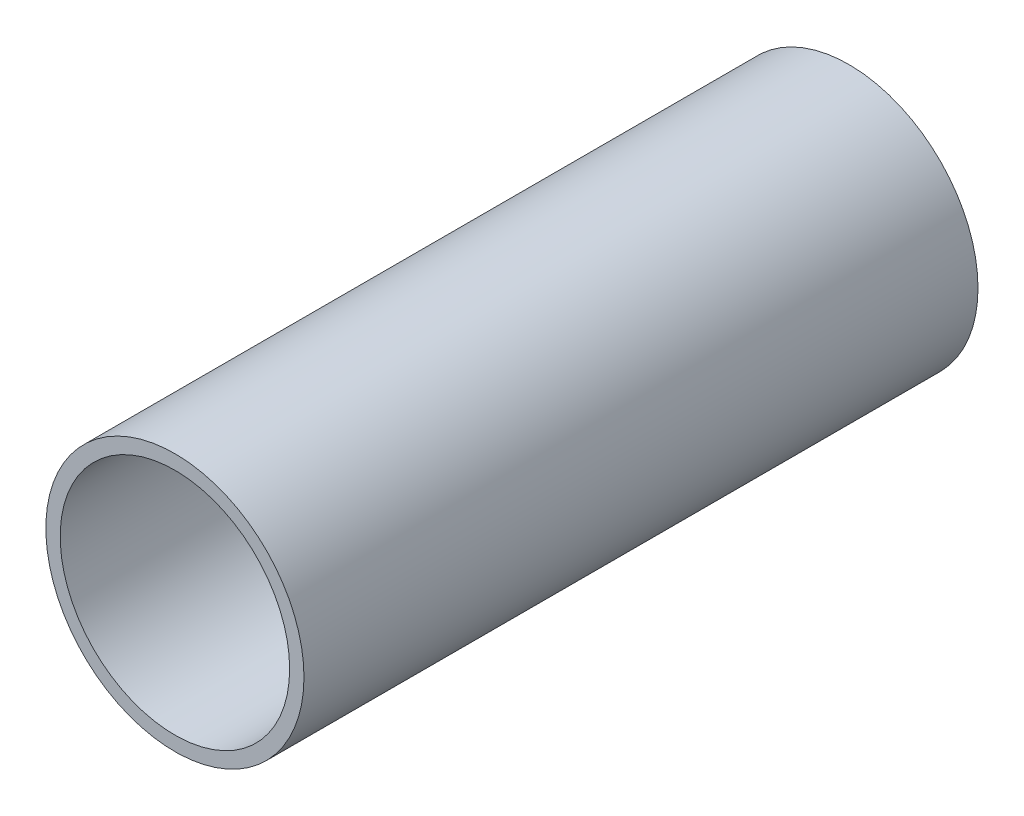
ISO-10303-21;
HEADER;
FILE_DESCRIPTION(('STEP AP214'),'2;1');
FILE_NAME('part.step','',(''),(''),'','','');
FILE_SCHEMA(('AUTOMOTIVE_DESIGN { 1 0 10303 214 1 1 1 1 }'));
ENDSEC;
DATA;
#1=APPLICATION_CONTEXT('core data for automotive mechanical design processes');
#2=APPLICATION_PROTOCOL_DEFINITION('international standard','automotive_design',2000,#1);
#3=PRODUCT_CONTEXT('',#1,'mechanical');
#4=PRODUCT('Part','Part','',(#3));
#5=PRODUCT_RELATED_PRODUCT_CATEGORY('part','',(#4));
#6=PRODUCT_DEFINITION_FORMATION('','',#4);
#7=PRODUCT_DEFINITION_CONTEXT('part definition',#1,'design');
#8=PRODUCT_DEFINITION('design','',#6,#7);
#9=PRODUCT_DEFINITION_SHAPE('','',#8);
#10=(LENGTH_UNIT() NAMED_UNIT(*) SI_UNIT(.MILLI.,.METRE.));
#11=(NAMED_UNIT(*) PLANE_ANGLE_UNIT() SI_UNIT($,.RADIAN.));
#12=(NAMED_UNIT(*) SI_UNIT($,.STERADIAN.) SOLID_ANGLE_UNIT());
#13=UNCERTAINTY_MEASURE_WITH_UNIT(LENGTH_MEASURE(1.E-05),#10,'distance_accuracy_value','');
#14=(GEOMETRIC_REPRESENTATION_CONTEXT(3) GLOBAL_UNCERTAINTY_ASSIGNED_CONTEXT((#13)) GLOBAL_UNIT_ASSIGNED_CONTEXT((#10,
#11,#12)) REPRESENTATION_CONTEXT('',''));
#15=CARTESIAN_POINT('',(0.,0.,0.));
#16=DIRECTION('',(0.,0.,1.));
#17=DIRECTION('',(1.,0.,0.));
#18=AXIS2_PLACEMENT_3D('',#15,#16,#17);
#19=CARTESIAN_POINT('',(0.,0.,149.225));
#20=DIRECTION('',(0.,0.,1.));
#21=DIRECTION('',(1.,0.,0.));
#22=AXIS2_PLACEMENT_3D('',#19,#20,#21);
#23=PLANE('',#22);
#24=CARTESIAN_POINT('',(0.,0.,149.225));
#25=DIRECTION('',(0.,0.,1.));
#26=DIRECTION('',(1.,0.,0.));
#27=AXIS2_PLACEMENT_3D('',#24,#25,#26);
#28=CIRCLE('',#27,57.15);
#29=CARTESIAN_POINT('',(57.15,0.,149.225));
#30=VERTEX_POINT('',#29);
#31=EDGE_CURVE('E10',#30,#30,#28,.T.);
#32=ORIENTED_EDGE('',*,*,#31,.T.);
#33=EDGE_LOOP('',(#32));
#34=FACE_BOUND('',#33,.T.);
#35=CARTESIAN_POINT('',(0.,0.,149.225));
#36=DIRECTION('',(0.,0.,1.));
#37=DIRECTION('',(1.,0.,0.));
#38=AXIS2_PLACEMENT_3D('',#35,#36,#37);
#39=CIRCLE('',#38,50.8);
#40=CARTESIAN_POINT('',(50.8,0.,149.225));
#41=VERTEX_POINT('',#40);
#42=EDGE_CURVE('E43',#41,#41,#39,.T.);
#43=ORIENTED_EDGE('',*,*,#42,.F.);
#44=EDGE_LOOP('',(#43));
#45=FACE_BOUND('',#44,.T.);
#46=ADVANCED_FACE('F32',(#34,#45),#23,.T.);
#47=CARTESIAN_POINT('',(0.,0.,-149.225));
#48=DIRECTION('',(0.,0.,1.));
#49=DIRECTION('',(1.,0.,0.));
#50=AXIS2_PLACEMENT_3D('',#47,#48,#49);
#51=PLANE('',#50);
#52=CARTESIAN_POINT('',(0.,0.,-149.225));
#53=DIRECTION('',(0.,0.,1.));
#54=DIRECTION('',(1.,0.,0.));
#55=AXIS2_PLACEMENT_3D('',#52,#53,#54);
#56=CIRCLE('',#55,57.15);
#57=CARTESIAN_POINT('',(57.15,0.,-149.225));
#58=VERTEX_POINT('',#57);
#59=EDGE_CURVE('E36',#58,#58,#56,.T.);
#60=ORIENTED_EDGE('',*,*,#59,.F.);
#61=EDGE_LOOP('',(#60));
#62=FACE_BOUND('',#61,.T.);
#63=CARTESIAN_POINT('',(0.,0.,-149.225));
#64=DIRECTION('',(0.,0.,1.));
#65=DIRECTION('',(1.,0.,0.));
#66=AXIS2_PLACEMENT_3D('',#63,#64,#65);
#67=CIRCLE('',#66,50.8);
#68=CARTESIAN_POINT('',(50.8,0.,-149.225));
#69=VERTEX_POINT('',#68);
#70=EDGE_CURVE('E45',#69,#69,#67,.T.);
#71=ORIENTED_EDGE('',*,*,#70,.T.);
#72=EDGE_LOOP('',(#71));
#73=FACE_BOUND('',#72,.T.);
#74=ADVANCED_FACE('F55',(#62,#73),#51,.F.);
#75=CARTESIAN_POINT('',(0.,0.,149.225));
#76=DIRECTION('',(0.,0.,-1.));
#77=DIRECTION('',(-1.,0.,0.));
#78=AXIS2_PLACEMENT_3D('',#75,#76,#77);
#79=CYLINDRICAL_SURFACE('',#78,57.15);
#80=ORIENTED_EDGE('',*,*,#31,.F.);
#81=EDGE_LOOP('',(#80));
#82=FACE_BOUND('',#81,.T.);
#83=ORIENTED_EDGE('',*,*,#59,.T.);
#84=EDGE_LOOP('',(#83));
#85=FACE_BOUND('',#84,.T.);
#86=ADVANCED_FACE('F34',(#82,#85),#79,.T.);
#87=CARTESIAN_POINT('',(0.,0.,149.225));
#88=DIRECTION('',(0.,0.,-1.));
#89=DIRECTION('',(-1.,0.,0.));
#90=AXIS2_PLACEMENT_3D('',#87,#88,#89);
#91=CYLINDRICAL_SURFACE('',#90,50.8);
#92=ORIENTED_EDGE('',*,*,#42,.T.);
#93=EDGE_LOOP('',(#92));
#94=FACE_BOUND('',#93,.T.);
#95=ORIENTED_EDGE('',*,*,#70,.F.);
#96=EDGE_LOOP('',(#95));
#97=FACE_BOUND('',#96,.T.);
#98=ADVANCED_FACE('F51',(#94,#97),#91,.F.);
#99=CLOSED_SHELL('',(#46,#74,#86,#98));
#100=MANIFOLD_SOLID_BREP('B2',#99);
#101=ADVANCED_BREP_SHAPE_REPRESENTATION('',(#18,#100),#14);
#102=SHAPE_DEFINITION_REPRESENTATION(#9,#101);
ENDSEC;
END-ISO-10303-21;
